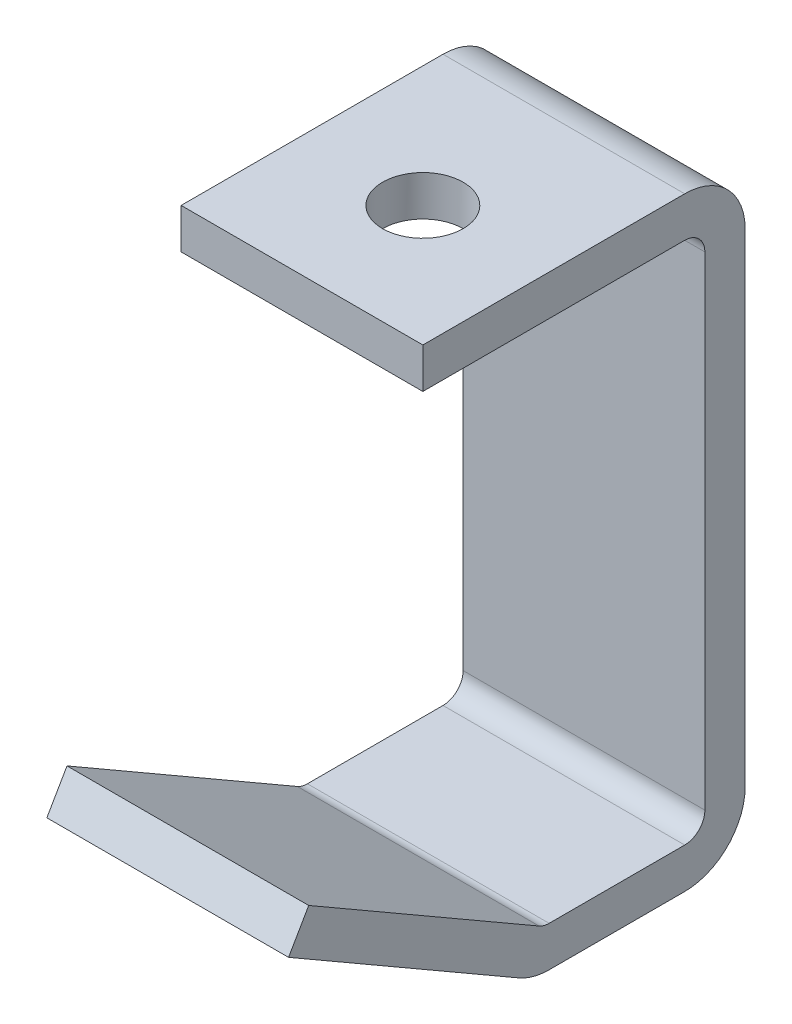
ISO-10303-21;
HEADER;
FILE_DESCRIPTION(('STEP AP214'),'2;1');
FILE_NAME('part.step','',(''),(''),'','','');
FILE_SCHEMA(('AUTOMOTIVE_DESIGN { 1 0 10303 214 1 1 1 1 }'));
ENDSEC;
DATA;
#1=APPLICATION_CONTEXT('core data for automotive mechanical design processes');
#2=APPLICATION_PROTOCOL_DEFINITION('international standard','automotive_design',2000,#1);
#3=PRODUCT_CONTEXT('',#1,'mechanical');
#4=PRODUCT('Part','Part','',(#3));
#5=PRODUCT_RELATED_PRODUCT_CATEGORY('part','',(#4));
#6=PRODUCT_DEFINITION_FORMATION('','',#4);
#7=PRODUCT_DEFINITION_CONTEXT('part definition',#1,'design');
#8=PRODUCT_DEFINITION('design','',#6,#7);
#9=PRODUCT_DEFINITION_SHAPE('','',#8);
#10=(LENGTH_UNIT() NAMED_UNIT(*) SI_UNIT(.MILLI.,.METRE.));
#11=(NAMED_UNIT(*) PLANE_ANGLE_UNIT() SI_UNIT($,.RADIAN.));
#12=(NAMED_UNIT(*) SI_UNIT($,.STERADIAN.) SOLID_ANGLE_UNIT());
#13=UNCERTAINTY_MEASURE_WITH_UNIT(LENGTH_MEASURE(1.E-05),#10,'distance_accuracy_value','');
#14=(GEOMETRIC_REPRESENTATION_CONTEXT(3) GLOBAL_UNCERTAINTY_ASSIGNED_CONTEXT((#13)) GLOBAL_UNIT_ASSIGNED_CONTEXT((#10,
#11,#12)) REPRESENTATION_CONTEXT('',''));
#15=CARTESIAN_POINT('',(0.,0.,0.));
#16=DIRECTION('',(0.,0.,1.));
#17=DIRECTION('',(1.,0.,0.));
#18=AXIS2_PLACEMENT_3D('',#15,#16,#17);
#19=CARTESIAN_POINT('',(19.05,88.9,3.175));
#20=DIRECTION('',(0.,-1.,0.));
#21=DIRECTION('',(0.,0.,-1.));
#22=AXIS2_PLACEMENT_3D('',#19,#20,#21);
#23=PLANE('',#22);
#24=CARTESIAN_POINT('',(0.,88.9,25.4));
#25=DIRECTION('',(0.,1.,0.));
#26=DIRECTION('',(0.,0.,1.));
#27=AXIS2_PLACEMENT_3D('',#24,#25,#26);
#28=CIRCLE('',#27,6.35);
#29=CARTESIAN_POINT('',(0.,88.9,31.75));
#30=VERTEX_POINT('',#29);
#31=EDGE_CURVE('E173',#30,#30,#28,.T.);
#32=ORIENTED_EDGE('',*,*,#31,.F.);
#33=EDGE_LOOP('',(#32));
#34=FACE_BOUND('',#33,.T.);
#35=DIRECTION('',(0.,0.,-1.));
#36=VECTOR('',#35,1.);
#37=CARTESIAN_POINT('',(-19.05,88.9,3.175));
#38=LINE('',#37,#36);
#39=CARTESIAN_POINT('',(-19.05,88.9,3.175));
#40=VERTEX_POINT('',#39);
#41=CARTESIAN_POINT('',(-19.05,88.9,44.45));
#42=VERTEX_POINT('',#41);
#43=EDGE_CURVE('E169',#40,#42,#38,.F.);
#44=ORIENTED_EDGE('',*,*,#43,.T.);
#45=DIRECTION('',(-1.,0.,0.));
#46=VECTOR('',#45,1.);
#47=CARTESIAN_POINT('',(19.05,88.9,44.45));
#48=LINE('',#47,#46);
#49=CARTESIAN_POINT('',(19.05,88.9,44.45));
#50=VERTEX_POINT('',#49);
#51=EDGE_CURVE('E13',#50,#42,#48,.T.);
#52=ORIENTED_EDGE('',*,*,#51,.F.);
#53=DIRECTION('',(0.,0.,-1.));
#54=VECTOR('',#53,1.);
#55=CARTESIAN_POINT('',(19.05,88.9,3.175));
#56=LINE('',#55,#54);
#57=CARTESIAN_POINT('',(19.05,88.9,3.175));
#58=VERTEX_POINT('',#57);
#59=EDGE_CURVE('E215',#58,#50,#56,.F.);
#60=ORIENTED_EDGE('',*,*,#59,.F.);
#61=DIRECTION('',(-1.,0.,0.));
#62=VECTOR('',#61,1.);
#63=CARTESIAN_POINT('',(19.05,88.9,3.175));
#64=LINE('',#63,#62);
#65=EDGE_CURVE('E170',#58,#40,#64,.T.);
#66=ORIENTED_EDGE('',*,*,#65,.T.);
#67=EDGE_LOOP('',(#44,#52,#60,#66));
#68=FACE_BOUND('',#67,.T.);
#69=ADVANCED_FACE('F47',(#34,#68),#23,.F.);
#70=CARTESIAN_POINT('',(19.05,82.55,44.45));
#71=DIRECTION('',(0.,0.,1.));
#72=DIRECTION('',(1.,0.,0.));
#73=AXIS2_PLACEMENT_3D('',#70,#71,#72);
#74=PLANE('',#73);
#75=DIRECTION('',(0.,1.,0.));
#76=VECTOR('',#75,1.);
#77=CARTESIAN_POINT('',(-19.05,82.55,44.45));
#78=LINE('',#77,#76);
#79=CARTESIAN_POINT('',(-19.05,82.55,44.45));
#80=VERTEX_POINT('',#79);
#81=EDGE_CURVE('E161',#80,#42,#78,.T.);
#82=ORIENTED_EDGE('',*,*,#81,.F.);
#83=DIRECTION('',(-1.,0.,0.));
#84=VECTOR('',#83,1.);
#85=CARTESIAN_POINT('',(19.05,82.55,44.45));
#86=LINE('',#85,#84);
#87=CARTESIAN_POINT('',(19.05,82.55,44.45));
#88=VERTEX_POINT('',#87);
#89=EDGE_CURVE('E54',#88,#80,#86,.T.);
#90=ORIENTED_EDGE('',*,*,#89,.F.);
#91=DIRECTION('',(0.,1.,0.));
#92=VECTOR('',#91,1.);
#93=CARTESIAN_POINT('',(19.05,82.55,44.45));
#94=LINE('',#93,#92);
#95=EDGE_CURVE('E164',#88,#50,#94,.T.);
#96=ORIENTED_EDGE('',*,*,#95,.T.);
#97=ORIENTED_EDGE('',*,*,#51,.T.);
#98=EDGE_LOOP('',(#82,#90,#96,#97));
#99=FACE_BOUND('',#98,.T.);
#100=ADVANCED_FACE('F159',(#99),#74,.T.);
#101=CARTESIAN_POINT('',(19.05,82.55,3.175));
#102=DIRECTION('',(0.,-1.,0.));
#103=DIRECTION('',(0.,0.,-1.));
#104=AXIS2_PLACEMENT_3D('',#101,#102,#103);
#105=PLANE('',#104);
#106=CARTESIAN_POINT('',(0.,82.55,25.4));
#107=DIRECTION('',(0.,-1.,0.));
#108=DIRECTION('',(0.,0.,-1.));
#109=AXIS2_PLACEMENT_3D('',#106,#107,#108);
#110=CIRCLE('',#109,6.35);
#111=CARTESIAN_POINT('',(0.,82.55,19.05));
#112=VERTEX_POINT('',#111);
#113=EDGE_CURVE('E356',#112,#112,#110,.F.);
#114=ORIENTED_EDGE('',*,*,#113,.T.);
#115=EDGE_LOOP('',(#114));
#116=FACE_BOUND('',#115,.T.);
#117=DIRECTION('',(0.,0.,1.));
#118=VECTOR('',#117,1.);
#119=CARTESIAN_POINT('',(-19.05,82.55,3.175));
#120=LINE('',#119,#118);
#121=CARTESIAN_POINT('',(-19.05,82.55,3.175));
#122=VERTEX_POINT('',#121);
#123=EDGE_CURVE('E178',#122,#80,#120,.T.);
#124=ORIENTED_EDGE('',*,*,#123,.F.);
#125=DIRECTION('',(-1.,0.,0.));
#126=VECTOR('',#125,1.);
#127=CARTESIAN_POINT('',(19.05,82.55,3.175));
#128=LINE('',#127,#126);
#129=CARTESIAN_POINT('',(19.05,82.55,3.175));
#130=VERTEX_POINT('',#129);
#131=EDGE_CURVE('E282',#130,#122,#128,.T.);
#132=ORIENTED_EDGE('',*,*,#131,.F.);
#133=DIRECTION('',(0.,0.,1.));
#134=VECTOR('',#133,1.);
#135=CARTESIAN_POINT('',(19.05,82.55,3.175));
#136=LINE('',#135,#134);
#137=EDGE_CURVE('E218',#130,#88,#136,.T.);
#138=ORIENTED_EDGE('',*,*,#137,.T.);
#139=ORIENTED_EDGE('',*,*,#89,.T.);
#140=EDGE_LOOP('',(#124,#132,#138,#139));
#141=FACE_BOUND('',#140,.T.);
#142=ADVANCED_FACE('F284',(#116,#141),#105,.T.);
#143=CARTESIAN_POINT('',(19.05,79.375,3.175));
#144=DIRECTION('',(-1.,0.,0.));
#145=DIRECTION('',(0.,0.,1.));
#146=AXIS2_PLACEMENT_3D('',#143,#144,#145);
#147=CYLINDRICAL_SURFACE('',#146,3.175);
#148=CARTESIAN_POINT('',(-19.05,79.375,3.175));
#149=DIRECTION('',(1.,0.,0.));
#150=DIRECTION('',(0.,0.,-1.));
#151=AXIS2_PLACEMENT_3D('',#148,#149,#150);
#152=CIRCLE('',#151,3.175);
#153=CARTESIAN_POINT('',(-19.05,79.375,0.));
#154=VERTEX_POINT('',#153);
#155=EDGE_CURVE('E180',#154,#122,#152,.T.);
#156=ORIENTED_EDGE('',*,*,#155,.F.);
#157=DIRECTION('',(-1.,0.,0.));
#158=VECTOR('',#157,1.);
#159=CARTESIAN_POINT('',(19.05,79.375,0.));
#160=LINE('',#159,#158);
#161=CARTESIAN_POINT('',(19.05,79.375,0.));
#162=VERTEX_POINT('',#161);
#163=EDGE_CURVE('E280',#162,#154,#160,.T.);
#164=ORIENTED_EDGE('',*,*,#163,.F.);
#165=CARTESIAN_POINT('',(19.05,79.375,3.175));
#166=DIRECTION('',(1.,0.,0.));
#167=DIRECTION('',(0.,0.,-1.));
#168=AXIS2_PLACEMENT_3D('',#165,#166,#167);
#169=CIRCLE('',#168,3.175);
#170=EDGE_CURVE('E221',#162,#130,#169,.T.);
#171=ORIENTED_EDGE('',*,*,#170,.T.);
#172=ORIENTED_EDGE('',*,*,#131,.T.);
#173=EDGE_LOOP('',(#156,#164,#171,#172));
#174=FACE_BOUND('',#173,.T.);
#175=ADVANCED_FACE('F291',(#174),#147,.F.);
#176=CARTESIAN_POINT('',(19.05,3.175,0.));
#177=DIRECTION('',(0.,0.,1.));
#178=DIRECTION('',(1.,0.,0.));
#179=AXIS2_PLACEMENT_3D('',#176,#177,#178);
#180=PLANE('',#179);
#181=DIRECTION('',(0.,1.,0.));
#182=VECTOR('',#181,1.);
#183=CARTESIAN_POINT('',(-19.05,3.175,0.));
#184=LINE('',#183,#182);
#185=CARTESIAN_POINT('',(-19.05,3.175,0.));
#186=VERTEX_POINT('',#185);
#187=EDGE_CURVE('E185',#186,#154,#184,.T.);
#188=ORIENTED_EDGE('',*,*,#187,.F.);
#189=DIRECTION('',(-1.,0.,0.));
#190=VECTOR('',#189,1.);
#191=CARTESIAN_POINT('',(19.05,3.175,0.));
#192=LINE('',#191,#190);
#193=CARTESIAN_POINT('',(19.05,3.175,0.));
#194=VERTEX_POINT('',#193);
#195=EDGE_CURVE('E278',#194,#186,#192,.T.);
#196=ORIENTED_EDGE('',*,*,#195,.F.);
#197=DIRECTION('',(0.,1.,0.));
#198=VECTOR('',#197,1.);
#199=CARTESIAN_POINT('',(19.05,3.175,0.));
#200=LINE('',#199,#198);
#201=EDGE_CURVE('E224',#194,#162,#200,.T.);
#202=ORIENTED_EDGE('',*,*,#201,.T.);
#203=ORIENTED_EDGE('',*,*,#163,.T.);
#204=EDGE_LOOP('',(#188,#196,#202,#203));
#205=FACE_BOUND('',#204,.T.);
#206=ADVANCED_FACE('F294',(#205),#180,.T.);
#207=CARTESIAN_POINT('',(19.05,3.175,3.175));
#208=DIRECTION('',(-1.,0.,0.));
#209=DIRECTION('',(0.,0.,1.));
#210=AXIS2_PLACEMENT_3D('',#207,#208,#209);
#211=CYLINDRICAL_SURFACE('',#210,3.175);
#212=CARTESIAN_POINT('',(-19.05,3.175,3.175));
#213=DIRECTION('',(1.,0.,0.));
#214=DIRECTION('',(0.,0.,1.));
#215=AXIS2_PLACEMENT_3D('',#212,#213,#214);
#216=CIRCLE('',#215,3.175);
#217=CARTESIAN_POINT('',(-19.05,0.,3.175));
#218=VERTEX_POINT('',#217);
#219=EDGE_CURVE('E188',#218,#186,#216,.T.);
#220=ORIENTED_EDGE('',*,*,#219,.F.);
#221=DIRECTION('',(-1.,0.,0.));
#222=VECTOR('',#221,1.);
#223=CARTESIAN_POINT('',(19.05,0.,3.175));
#224=LINE('',#223,#222);
#225=CARTESIAN_POINT('',(19.05,0.,3.175));
#226=VERTEX_POINT('',#225);
#227=EDGE_CURVE('E276',#226,#218,#224,.T.);
#228=ORIENTED_EDGE('',*,*,#227,.F.);
#229=CARTESIAN_POINT('',(19.05,3.175,3.175));
#230=DIRECTION('',(1.,0.,0.));
#231=DIRECTION('',(0.,0.,1.));
#232=AXIS2_PLACEMENT_3D('',#229,#230,#231);
#233=CIRCLE('',#232,3.175);
#234=EDGE_CURVE('E227',#226,#194,#233,.T.);
#235=ORIENTED_EDGE('',*,*,#234,.T.);
#236=ORIENTED_EDGE('',*,*,#195,.T.);
#237=EDGE_LOOP('',(#220,#228,#235,#236));
#238=FACE_BOUND('',#237,.T.);
#239=ADVANCED_FACE('F299',(#238),#211,.F.);
#240=CARTESIAN_POINT('',(19.05,0.,24.5492613140311));
#241=DIRECTION('',(0.,1.,0.));
#242=DIRECTION('',(0.,0.,1.));
#243=AXIS2_PLACEMENT_3D('',#240,#241,#242);
#244=PLANE('',#243);
#245=DIRECTION('',(0.,0.,-1.));
#246=VECTOR('',#245,1.);
#247=CARTESIAN_POINT('',(-19.05,0.,24.5492613140311));
#248=LINE('',#247,#246);
#249=CARTESIAN_POINT('',(-19.05,0.,24.5492613140311));
#250=VERTEX_POINT('',#249);
#251=EDGE_CURVE('E191',#250,#218,#248,.T.);
#252=ORIENTED_EDGE('',*,*,#251,.F.);
#253=DIRECTION('',(-1.,0.,0.));
#254=VECTOR('',#253,1.);
#255=CARTESIAN_POINT('',(19.05,0.,24.5492613140311));
#256=LINE('',#255,#254);
#257=CARTESIAN_POINT('',(19.05,0.,24.5492613140311));
#258=VERTEX_POINT('',#257);
#259=EDGE_CURVE('E274',#258,#250,#256,.T.);
#260=ORIENTED_EDGE('',*,*,#259,.F.);
#261=DIRECTION('',(0.,0.,-1.));
#262=VECTOR('',#261,1.);
#263=CARTESIAN_POINT('',(19.05,0.,24.5492613140311));
#264=LINE('',#263,#262);
#265=EDGE_CURVE('E230',#258,#226,#264,.T.);
#266=ORIENTED_EDGE('',*,*,#265,.T.);
#267=ORIENTED_EDGE('',*,*,#227,.T.);
#268=EDGE_LOOP('',(#252,#260,#266,#267));
#269=FACE_BOUND('',#268,.T.);
#270=ADVANCED_FACE('F302',(#269),#244,.T.);
#271=CARTESIAN_POINT('',(19.05,3.175,24.5492613140312));
#272=DIRECTION('',(-1.,0.,0.));
#273=DIRECTION('',(0.,0.,1.));
#274=AXIS2_PLACEMENT_3D('',#271,#272,#273);
#275=CYLINDRICAL_SURFACE('',#274,3.17499999999997);
#276=CARTESIAN_POINT('',(-19.05,3.175,24.5492613140312));
#277=DIRECTION('',(1.,0.,0.));
#278=DIRECTION('',(0.,0.,-1.));
#279=AXIS2_PLACEMENT_3D('',#276,#277,#278);
#280=CIRCLE('',#279,3.17499999999997);
#281=CARTESIAN_POINT('',(-19.05,0.425369342984382,26.1367613140311));
#282=VERTEX_POINT('',#281);
#283=EDGE_CURVE('E194',#282,#250,#280,.T.);
#284=ORIENTED_EDGE('',*,*,#283,.F.);
#285=DIRECTION('',(-1.,0.,0.));
#286=VECTOR('',#285,1.);
#287=CARTESIAN_POINT('',(19.05,0.425369342984382,26.1367613140311));
#288=LINE('',#287,#286);
#289=CARTESIAN_POINT('',(19.05,0.425369342984382,26.1367613140311));
#290=VERTEX_POINT('',#289);
#291=EDGE_CURVE('E272',#290,#282,#288,.T.);
#292=ORIENTED_EDGE('',*,*,#291,.F.);
#293=CARTESIAN_POINT('',(19.05,3.175,24.5492613140312));
#294=DIRECTION('',(1.,0.,0.));
#295=DIRECTION('',(0.,0.,-1.));
#296=AXIS2_PLACEMENT_3D('',#293,#294,#295);
#297=CIRCLE('',#296,3.17499999999997);
#298=EDGE_CURVE('E233',#290,#258,#297,.T.);
#299=ORIENTED_EDGE('',*,*,#298,.T.);
#300=ORIENTED_EDGE('',*,*,#259,.T.);
#301=EDGE_LOOP('',(#284,#292,#299,#300));
#302=FACE_BOUND('',#301,.T.);
#303=ADVANCED_FACE('F307',(#302),#275,.F.);
#304=CARTESIAN_POINT('',(19.05,21.3868000000001,62.443024211314));
#305=DIRECTION('',(0.,0.866025403784439,-0.5));
#306=DIRECTION('',(0.,0.5,0.866025403784438));
#307=AXIS2_PLACEMENT_3D('',#304,#305,#306);
#308=PLANE('',#307);
#309=DIRECTION('',(0.,-0.5,-0.866025403784439));
#310=VECTOR('',#309,1.);
#311=CARTESIAN_POINT('',(-19.05,21.3868000000001,62.443024211314));
#312=LINE('',#311,#310);
#313=CARTESIAN_POINT('',(-19.05,21.3868000000001,62.443024211314));
#314=VERTEX_POINT('',#313);
#315=EDGE_CURVE('E197',#314,#282,#312,.T.);
#316=ORIENTED_EDGE('',*,*,#315,.F.);
#317=DIRECTION('',(-1.,0.,0.));
#318=VECTOR('',#317,1.);
#319=CARTESIAN_POINT('',(19.05,21.3868000000001,62.443024211314));
#320=LINE('',#319,#318);
#321=CARTESIAN_POINT('',(19.05,21.3868000000001,62.443024211314));
#322=VERTEX_POINT('',#321);
#323=EDGE_CURVE('E270',#322,#314,#320,.T.);
#324=ORIENTED_EDGE('',*,*,#323,.F.);
#325=DIRECTION('',(0.,-0.5,-0.866025403784439));
#326=VECTOR('',#325,1.);
#327=CARTESIAN_POINT('',(19.05,21.3868000000001,62.443024211314));
#328=LINE('',#327,#326);
#329=EDGE_CURVE('E236',#322,#290,#328,.T.);
#330=ORIENTED_EDGE('',*,*,#329,.T.);
#331=ORIENTED_EDGE('',*,*,#291,.T.);
#332=EDGE_LOOP('',(#316,#324,#330,#331));
#333=FACE_BOUND('',#332,.T.);
#334=ADVANCED_FACE('F310',(#333),#308,.T.);
#335=CARTESIAN_POINT('',(19.05,15.8875386859689,65.618024211314));
#336=DIRECTION('',(0.,0.500000000000001,0.866025403784438));
#337=DIRECTION('',(0.,-0.866025403784438,0.500000000000001));
#338=AXIS2_PLACEMENT_3D('',#335,#336,#337);
#339=PLANE('',#338);
#340=DIRECTION('',(0.,0.866025403784438,-0.500000000000001));
#341=VECTOR('',#340,1.);
#342=CARTESIAN_POINT('',(-19.05,15.8875386859689,65.618024211314));
#343=LINE('',#342,#341);
#344=CARTESIAN_POINT('',(-19.05,15.8875386859689,65.618024211314));
#345=VERTEX_POINT('',#344);
#346=EDGE_CURVE('E200',#345,#314,#343,.T.);
#347=ORIENTED_EDGE('',*,*,#346,.F.);
#348=DIRECTION('',(-1.,0.,0.));
#349=VECTOR('',#348,1.);
#350=CARTESIAN_POINT('',(19.05,15.8875386859689,65.618024211314));
#351=LINE('',#350,#349);
#352=CARTESIAN_POINT('',(19.05,15.8875386859689,65.618024211314));
#353=VERTEX_POINT('',#352);
#354=EDGE_CURVE('E268',#353,#345,#351,.T.);
#355=ORIENTED_EDGE('',*,*,#354,.F.);
#356=DIRECTION('',(0.,0.866025403784438,-0.500000000000001));
#357=VECTOR('',#356,1.);
#358=CARTESIAN_POINT('',(19.05,15.8875386859689,65.618024211314));
#359=LINE('',#358,#357);
#360=EDGE_CURVE('E239',#353,#322,#359,.T.);
#361=ORIENTED_EDGE('',*,*,#360,.T.);
#362=ORIENTED_EDGE('',*,*,#323,.T.);
#363=EDGE_LOOP('',(#347,#355,#361,#362));
#364=FACE_BOUND('',#363,.T.);
#365=ADVANCED_FACE('F314',(#364),#339,.T.);
#366=CARTESIAN_POINT('',(19.05,15.8875386859689,65.618024211314));
#367=DIRECTION('',(0.,0.866025403784439,-0.5));
#368=DIRECTION('',(0.,0.5,0.866025403784438));
#369=AXIS2_PLACEMENT_3D('',#366,#367,#368);
#370=PLANE('',#369);
#371=DIRECTION('',(0.,-0.5,-0.866025403784439));
#372=VECTOR('',#371,1.);
#373=CARTESIAN_POINT('',(-19.05,15.8875386859689,65.618024211314));
#374=LINE('',#373,#372);
#375=CARTESIAN_POINT('',(-19.05,-5.0738919710469,29.3117613140309));
#376=VERTEX_POINT('',#375);
#377=EDGE_CURVE('E203',#345,#376,#374,.T.);
#378=ORIENTED_EDGE('',*,*,#377,.T.);
#379=DIRECTION('',(-1.,0.,0.));
#380=VECTOR('',#379,1.);
#381=CARTESIAN_POINT('',(19.05,-5.0738919710469,29.3117613140309));
#382=LINE('',#381,#380);
#383=CARTESIAN_POINT('',(19.05,-5.0738919710469,29.3117613140309));
#384=VERTEX_POINT('',#383);
#385=EDGE_CURVE('E265',#384,#376,#382,.T.);
#386=ORIENTED_EDGE('',*,*,#385,.F.);
#387=DIRECTION('',(0.,-0.5,-0.866025403784439));
#388=VECTOR('',#387,1.);
#389=CARTESIAN_POINT('',(19.05,15.8875386859689,65.618024211314));
#390=LINE('',#389,#388);
#391=EDGE_CURVE('E242',#353,#384,#390,.T.);
#392=ORIENTED_EDGE('',*,*,#391,.F.);
#393=ORIENTED_EDGE('',*,*,#354,.T.);
#394=EDGE_LOOP('',(#378,#386,#392,#393));
#395=FACE_BOUND('',#394,.T.);
#396=ADVANCED_FACE('F319',(#395),#370,.F.);
#397=CARTESIAN_POINT('',(19.05,3.175,24.5492613140312));
#398=DIRECTION('',(-1.,0.,0.));
#399=DIRECTION('',(0.,0.,1.));
#400=AXIS2_PLACEMENT_3D('',#397,#398,#399);
#401=CYLINDRICAL_SURFACE('',#400,9.52499999999997);
#402=CARTESIAN_POINT('',(-19.05,3.175,24.5492613140312));
#403=DIRECTION('',(1.,0.,0.));
#404=DIRECTION('',(0.,0.,-1.));
#405=AXIS2_PLACEMENT_3D('',#402,#403,#404);
#406=CIRCLE('',#405,9.52499999999997);
#407=CARTESIAN_POINT('',(-19.05,-6.35,24.5492613140311));
#408=VERTEX_POINT('',#407);
#409=EDGE_CURVE('E205',#376,#408,#406,.T.);
#410=ORIENTED_EDGE('',*,*,#409,.T.);
#411=DIRECTION('',(-1.,0.,0.));
#412=VECTOR('',#411,1.);
#413=CARTESIAN_POINT('',(19.05,-6.35,24.5492613140311));
#414=LINE('',#413,#412);
#415=CARTESIAN_POINT('',(19.05,-6.35,24.5492613140311));
#416=VERTEX_POINT('',#415);
#417=EDGE_CURVE('E262',#416,#408,#414,.T.);
#418=ORIENTED_EDGE('',*,*,#417,.F.);
#419=CARTESIAN_POINT('',(19.05,3.175,24.5492613140312));
#420=DIRECTION('',(1.,0.,0.));
#421=DIRECTION('',(0.,0.,-1.));
#422=AXIS2_PLACEMENT_3D('',#419,#420,#421);
#423=CIRCLE('',#422,9.52499999999997);
#424=EDGE_CURVE('E244',#384,#416,#423,.T.);
#425=ORIENTED_EDGE('',*,*,#424,.F.);
#426=ORIENTED_EDGE('',*,*,#385,.T.);
#427=EDGE_LOOP('',(#410,#418,#425,#426));
#428=FACE_BOUND('',#427,.T.);
#429=ADVANCED_FACE('F325',(#428),#401,.T.);
#430=CARTESIAN_POINT('',(19.05,-6.35,24.5492613140311));
#431=DIRECTION('',(0.,1.,0.));
#432=DIRECTION('',(0.,0.,1.));
#433=AXIS2_PLACEMENT_3D('',#430,#431,#432);
#434=PLANE('',#433);
#435=DIRECTION('',(0.,0.,-1.));
#436=VECTOR('',#435,1.);
#437=CARTESIAN_POINT('',(-19.05,-6.35,24.5492613140311));
#438=LINE('',#437,#436);
#439=CARTESIAN_POINT('',(-19.05,-6.35,3.175));
#440=VERTEX_POINT('',#439);
#441=EDGE_CURVE('E207',#408,#440,#438,.T.);
#442=ORIENTED_EDGE('',*,*,#441,.T.);
#443=DIRECTION('',(-1.,0.,0.));
#444=VECTOR('',#443,1.);
#445=CARTESIAN_POINT('',(19.05,-6.35,3.175));
#446=LINE('',#445,#444);
#447=CARTESIAN_POINT('',(19.05,-6.35,3.175));
#448=VERTEX_POINT('',#447);
#449=EDGE_CURVE('E259',#448,#440,#446,.T.);
#450=ORIENTED_EDGE('',*,*,#449,.F.);
#451=DIRECTION('',(0.,0.,-1.));
#452=VECTOR('',#451,1.);
#453=CARTESIAN_POINT('',(19.05,-6.35,24.5492613140311));
#454=LINE('',#453,#452);
#455=EDGE_CURVE('E246',#416,#448,#454,.T.);
#456=ORIENTED_EDGE('',*,*,#455,.F.);
#457=ORIENTED_EDGE('',*,*,#417,.T.);
#458=EDGE_LOOP('',(#442,#450,#456,#457));
#459=FACE_BOUND('',#458,.T.);
#460=ADVANCED_FACE('F329',(#459),#434,.F.);
#461=CARTESIAN_POINT('',(19.05,3.175,3.175));
#462=DIRECTION('',(-1.,0.,0.));
#463=DIRECTION('',(0.,0.,1.));
#464=AXIS2_PLACEMENT_3D('',#461,#462,#463);
#465=CYLINDRICAL_SURFACE('',#464,9.525);
#466=CARTESIAN_POINT('',(-19.05,3.175,3.175));
#467=DIRECTION('',(1.,0.,0.));
#468=DIRECTION('',(0.,0.,-1.));
#469=AXIS2_PLACEMENT_3D('',#466,#467,#468);
#470=CIRCLE('',#469,9.525);
#471=CARTESIAN_POINT('',(-19.05,3.175,-6.35));
#472=VERTEX_POINT('',#471);
#473=EDGE_CURVE('E209',#440,#472,#470,.T.);
#474=ORIENTED_EDGE('',*,*,#473,.T.);
#475=DIRECTION('',(-1.,0.,0.));
#476=VECTOR('',#475,1.);
#477=CARTESIAN_POINT('',(19.05,3.175,-6.35));
#478=LINE('',#477,#476);
#479=CARTESIAN_POINT('',(19.05,3.175,-6.35));
#480=VERTEX_POINT('',#479);
#481=EDGE_CURVE('E256',#480,#472,#478,.T.);
#482=ORIENTED_EDGE('',*,*,#481,.F.);
#483=CARTESIAN_POINT('',(19.05,3.175,3.175));
#484=DIRECTION('',(1.,0.,0.));
#485=DIRECTION('',(0.,0.,-1.));
#486=AXIS2_PLACEMENT_3D('',#483,#484,#485);
#487=CIRCLE('',#486,9.525);
#488=EDGE_CURVE('E248',#448,#480,#487,.T.);
#489=ORIENTED_EDGE('',*,*,#488,.F.);
#490=ORIENTED_EDGE('',*,*,#449,.T.);
#491=EDGE_LOOP('',(#474,#482,#489,#490));
#492=FACE_BOUND('',#491,.T.);
#493=ADVANCED_FACE('F334',(#492),#465,.T.);
#494=CARTESIAN_POINT('',(19.05,3.175,-6.35));
#495=DIRECTION('',(0.,0.,1.));
#496=DIRECTION('',(1.,0.,0.));
#497=AXIS2_PLACEMENT_3D('',#494,#495,#496);
#498=PLANE('',#497);
#499=DIRECTION('',(0.,1.,0.));
#500=VECTOR('',#499,1.);
#501=CARTESIAN_POINT('',(-19.05,3.175,-6.35));
#502=LINE('',#501,#500);
#503=CARTESIAN_POINT('',(-19.05,79.375,-6.35));
#504=VERTEX_POINT('',#503);
#505=EDGE_CURVE('E211',#472,#504,#502,.T.);
#506=ORIENTED_EDGE('',*,*,#505,.T.);
#507=DIRECTION('',(-1.,0.,0.));
#508=VECTOR('',#507,1.);
#509=CARTESIAN_POINT('',(19.05,79.375,-6.35));
#510=LINE('',#509,#508);
#511=CARTESIAN_POINT('',(19.05,79.375,-6.35));
#512=VERTEX_POINT('',#511);
#513=EDGE_CURVE('E253',#512,#504,#510,.T.);
#514=ORIENTED_EDGE('',*,*,#513,.F.);
#515=DIRECTION('',(0.,1.,0.));
#516=VECTOR('',#515,1.);
#517=CARTESIAN_POINT('',(19.05,3.175,-6.35));
#518=LINE('',#517,#516);
#519=EDGE_CURVE('E66',#480,#512,#518,.T.);
#520=ORIENTED_EDGE('',*,*,#519,.F.);
#521=ORIENTED_EDGE('',*,*,#481,.T.);
#522=EDGE_LOOP('',(#506,#514,#520,#521));
#523=FACE_BOUND('',#522,.T.);
#524=ADVANCED_FACE('F337',(#523),#498,.F.);
#525=CARTESIAN_POINT('',(19.05,79.375,3.175));
#526=DIRECTION('',(-1.,0.,0.));
#527=DIRECTION('',(0.,0.,1.));
#528=AXIS2_PLACEMENT_3D('',#525,#526,#527);
#529=CYLINDRICAL_SURFACE('',#528,9.525);
#530=CARTESIAN_POINT('',(-19.05,79.375,3.175));
#531=DIRECTION('',(1.,0.,0.));
#532=DIRECTION('',(0.,0.,-1.));
#533=AXIS2_PLACEMENT_3D('',#530,#531,#532);
#534=CIRCLE('',#533,9.525);
#535=EDGE_CURVE('E213',#504,#40,#534,.T.);
#536=ORIENTED_EDGE('',*,*,#535,.T.);
#537=ORIENTED_EDGE('',*,*,#65,.F.);
#538=CARTESIAN_POINT('',(19.05,79.375,3.175));
#539=DIRECTION('',(1.,0.,0.));
#540=DIRECTION('',(0.,0.,-1.));
#541=AXIS2_PLACEMENT_3D('',#538,#539,#540);
#542=CIRCLE('',#541,9.525);
#543=EDGE_CURVE('E61',#512,#58,#542,.T.);
#544=ORIENTED_EDGE('',*,*,#543,.F.);
#545=ORIENTED_EDGE('',*,*,#513,.T.);
#546=EDGE_LOOP('',(#536,#537,#544,#545));
#547=FACE_BOUND('',#546,.T.);
#548=ADVANCED_FACE('F339',(#547),#529,.T.);
#549=CARTESIAN_POINT('',(19.05,79.375,3.175));
#550=DIRECTION('',(1.,0.,0.));
#551=DIRECTION('',(0.,0.,-1.));
#552=AXIS2_PLACEMENT_3D('',#549,#550,#551);
#553=PLANE('',#552);
#554=ORIENTED_EDGE('',*,*,#59,.T.);
#555=ORIENTED_EDGE('',*,*,#95,.F.);
#556=ORIENTED_EDGE('',*,*,#137,.F.);
#557=ORIENTED_EDGE('',*,*,#170,.F.);
#558=ORIENTED_EDGE('',*,*,#201,.F.);
#559=ORIENTED_EDGE('',*,*,#234,.F.);
#560=ORIENTED_EDGE('',*,*,#265,.F.);
#561=ORIENTED_EDGE('',*,*,#298,.F.);
#562=ORIENTED_EDGE('',*,*,#329,.F.);
#563=ORIENTED_EDGE('',*,*,#360,.F.);
#564=ORIENTED_EDGE('',*,*,#391,.T.);
#565=ORIENTED_EDGE('',*,*,#424,.T.);
#566=ORIENTED_EDGE('',*,*,#455,.T.);
#567=ORIENTED_EDGE('',*,*,#488,.T.);
#568=ORIENTED_EDGE('',*,*,#519,.T.);
#569=ORIENTED_EDGE('',*,*,#543,.T.);
#570=EDGE_LOOP('',(#554,#555,#556,#557,#558,#559,#560,#561,#562,#563,#564,#565,#566,#567,#568,#569));
#571=FACE_BOUND('',#570,.T.);
#572=ADVANCED_FACE('F286',(#571),#553,.T.);
#573=CARTESIAN_POINT('',(-19.05,79.375,3.175));
#574=DIRECTION('',(1.,0.,0.));
#575=DIRECTION('',(0.,0.,-1.));
#576=AXIS2_PLACEMENT_3D('',#573,#574,#575);
#577=PLANE('',#576);
#578=ORIENTED_EDGE('',*,*,#43,.F.);
#579=ORIENTED_EDGE('',*,*,#535,.F.);
#580=ORIENTED_EDGE('',*,*,#505,.F.);
#581=ORIENTED_EDGE('',*,*,#473,.F.);
#582=ORIENTED_EDGE('',*,*,#441,.F.);
#583=ORIENTED_EDGE('',*,*,#409,.F.);
#584=ORIENTED_EDGE('',*,*,#377,.F.);
#585=ORIENTED_EDGE('',*,*,#346,.T.);
#586=ORIENTED_EDGE('',*,*,#315,.T.);
#587=ORIENTED_EDGE('',*,*,#283,.T.);
#588=ORIENTED_EDGE('',*,*,#251,.T.);
#589=ORIENTED_EDGE('',*,*,#219,.T.);
#590=ORIENTED_EDGE('',*,*,#187,.T.);
#591=ORIENTED_EDGE('',*,*,#155,.T.);
#592=ORIENTED_EDGE('',*,*,#123,.T.);
#593=ORIENTED_EDGE('',*,*,#81,.T.);
#594=EDGE_LOOP('',(#578,#579,#580,#581,#582,#583,#584,#585,#586,#587,#588,#589,#590,#591,#592,#593));
#595=FACE_BOUND('',#594,.T.);
#596=ADVANCED_FACE('F175',(#595),#577,.F.);
#597=CARTESIAN_POINT('',(0.,-6.35100000000001,25.4));
#598=DIRECTION('',(0.,1.,0.));
#599=DIRECTION('',(0.,0.,1.));
#600=AXIS2_PLACEMENT_3D('',#597,#598,#599);
#601=CYLINDRICAL_SURFACE('',#600,6.35);
#602=ORIENTED_EDGE('',*,*,#113,.F.);
#603=EDGE_LOOP('',(#602));
#604=FACE_BOUND('',#603,.T.);
#605=ORIENTED_EDGE('',*,*,#31,.T.);
#606=EDGE_LOOP('',(#605));
#607=FACE_BOUND('',#606,.T.);
#608=ADVANCED_FACE('F362',(#604,#607),#601,.F.);
#609=CLOSED_SHELL('',(#69,#100,#142,#175,#206,#239,#270,#303,#334,#365,#396,#429,#460,#493,#524,
#548,#572,#596,#608));
#610=MANIFOLD_SOLID_BREP('B2',#609);
#611=ADVANCED_BREP_SHAPE_REPRESENTATION('',(#18,#610),#14);
#612=SHAPE_DEFINITION_REPRESENTATION(#9,#611);
ENDSEC;
END-ISO-10303-21;
